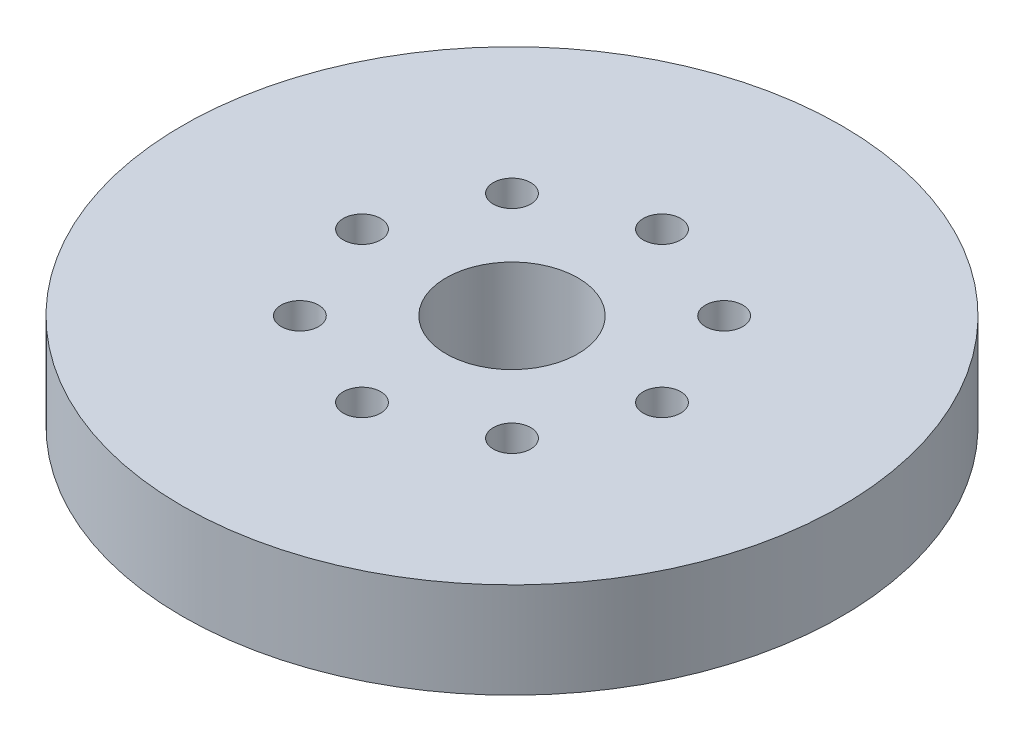
ISO-10303-21;
HEADER;
FILE_DESCRIPTION(('STEP AP214'),'2;1');
FILE_NAME('part.step','',(''),(''),'','','');
FILE_SCHEMA(('AUTOMOTIVE_DESIGN { 1 0 10303 214 1 1 1 1 }'));
ENDSEC;
DATA;
#1=APPLICATION_CONTEXT('core data for automotive mechanical design processes');
#2=APPLICATION_PROTOCOL_DEFINITION('international standard','automotive_design',2000,#1);
#3=PRODUCT_CONTEXT('',#1,'mechanical');
#4=PRODUCT('Part','Part','',(#3));
#5=PRODUCT_RELATED_PRODUCT_CATEGORY('part','',(#4));
#6=PRODUCT_DEFINITION_FORMATION('','',#4);
#7=PRODUCT_DEFINITION_CONTEXT('part definition',#1,'design');
#8=PRODUCT_DEFINITION('design','',#6,#7);
#9=PRODUCT_DEFINITION_SHAPE('','',#8);
#10=(LENGTH_UNIT() NAMED_UNIT(*) SI_UNIT(.MILLI.,.METRE.));
#11=(NAMED_UNIT(*) PLANE_ANGLE_UNIT() SI_UNIT($,.RADIAN.));
#12=(NAMED_UNIT(*) SI_UNIT($,.STERADIAN.) SOLID_ANGLE_UNIT());
#13=UNCERTAINTY_MEASURE_WITH_UNIT(LENGTH_MEASURE(1.E-05),#10,'distance_accuracy_value','');
#14=(GEOMETRIC_REPRESENTATION_CONTEXT(3) GLOBAL_UNCERTAINTY_ASSIGNED_CONTEXT((#13)) GLOBAL_UNIT_ASSIGNED_CONTEXT((#10,
#11,#12)) REPRESENTATION_CONTEXT('',''));
#15=CARTESIAN_POINT('',(0.,0.,0.));
#16=DIRECTION('',(0.,0.,1.));
#17=DIRECTION('',(1.,0.,0.));
#18=AXIS2_PLACEMENT_3D('',#15,#16,#17);
#19=CARTESIAN_POINT('',(0.,29.,0.));
#20=DIRECTION('',(0.,-1.,0.));
#21=DIRECTION('',(0.,0.,-1.));
#22=AXIS2_PLACEMENT_3D('',#19,#20,#21);
#23=CYLINDRICAL_SURFACE('',#22,100.);
#24=CARTESIAN_POINT('',(0.,29.,0.));
#25=DIRECTION('',(0.,1.,0.));
#26=DIRECTION('',(0.,0.,1.));
#27=AXIS2_PLACEMENT_3D('',#24,#25,#26);
#28=CIRCLE('',#27,100.);
#29=CARTESIAN_POINT('',(0.,29.,-100.));
#30=VERTEX_POINT('',#29);
#31=EDGE_CURVE('E10',#30,#30,#28,.T.);
#32=CARTESIAN_POINT('',(0.,0.,0.));
#33=DIRECTION('',(0.,1.,0.));
#34=DIRECTION('',(0.,0.,1.));
#35=AXIS2_PLACEMENT_3D('',#32,#33,#34);
#36=CIRCLE('',#35,100.);
#37=CARTESIAN_POINT('',(0.,0.,-100.));
#38=VERTEX_POINT('',#37);
#39=EDGE_CURVE('E37',#38,#38,#36,.T.);
#40=CARTESIAN_POINT('',(0.,29.,-100.));
#41=CARTESIAN_POINT('',(0.,28.6979166666667,-100.));
#42=CARTESIAN_POINT('',(0.,28.3958333333333,-100.));
#43=CARTESIAN_POINT('',(0.,27.7916666666667,-100.));
#44=CARTESIAN_POINT('',(0.,27.4895833333333,-100.));
#45=CARTESIAN_POINT('',(0.,26.8854166666667,-100.));
#46=CARTESIAN_POINT('',(0.,26.5833333333333,-100.));
#47=CARTESIAN_POINT('',(0.,25.9791666666667,-100.));
#48=CARTESIAN_POINT('',(0.,25.6770833333333,-100.));
#49=CARTESIAN_POINT('',(0.,25.0729166666667,-100.));
#50=CARTESIAN_POINT('',(0.,24.7708333333333,-100.));
#51=CARTESIAN_POINT('',(0.,24.1666666666667,-100.));
#52=CARTESIAN_POINT('',(0.,23.8645833333333,-100.));
#53=CARTESIAN_POINT('',(0.,23.2604166666667,-100.));
#54=CARTESIAN_POINT('',(0.,22.9583333333333,-100.));
#55=CARTESIAN_POINT('',(0.,22.3541666666667,-100.));
#56=CARTESIAN_POINT('',(0.,22.0520833333333,-100.));
#57=CARTESIAN_POINT('',(0.,21.4479166666667,-100.));
#58=CARTESIAN_POINT('',(0.,21.1458333333333,-100.));
#59=CARTESIAN_POINT('',(0.,20.5416666666667,-100.));
#60=CARTESIAN_POINT('',(0.,20.2395833333333,-100.));
#61=CARTESIAN_POINT('',(0.,19.6354166666667,-100.));
#62=CARTESIAN_POINT('',(0.,19.3333333333333,-100.));
#63=CARTESIAN_POINT('',(0.,18.7291666666667,-100.));
#64=CARTESIAN_POINT('',(0.,18.4270833333333,-100.));
#65=CARTESIAN_POINT('',(0.,17.8229166666667,-100.));
#66=CARTESIAN_POINT('',(0.,17.5208333333333,-100.));
#67=CARTESIAN_POINT('',(0.,16.9166666666667,-100.));
#68=CARTESIAN_POINT('',(0.,16.6145833333333,-100.));
#69=CARTESIAN_POINT('',(0.,16.0104166666667,-100.));
#70=CARTESIAN_POINT('',(0.,15.7083333333333,-100.));
#71=CARTESIAN_POINT('',(0.,15.1041666666667,-100.));
#72=CARTESIAN_POINT('',(0.,14.8020833333333,-100.));
#73=CARTESIAN_POINT('',(0.,14.1979166666667,-100.));
#74=CARTESIAN_POINT('',(0.,13.8958333333333,-100.));
#75=CARTESIAN_POINT('',(0.,13.2916666666667,-100.));
#76=CARTESIAN_POINT('',(0.,12.9895833333333,-100.));
#77=CARTESIAN_POINT('',(0.,12.3854166666667,-100.));
#78=CARTESIAN_POINT('',(0.,12.0833333333333,-100.));
#79=CARTESIAN_POINT('',(0.,11.4791666666667,-100.));
#80=CARTESIAN_POINT('',(0.,11.1770833333333,-100.));
#81=CARTESIAN_POINT('',(0.,10.5729166666667,-100.));
#82=CARTESIAN_POINT('',(0.,10.2708333333333,-100.));
#83=CARTESIAN_POINT('',(0.,9.66666666666667,-100.));
#84=CARTESIAN_POINT('',(0.,9.36458333333333,-100.));
#85=CARTESIAN_POINT('',(0.,8.76041666666667,-100.));
#86=CARTESIAN_POINT('',(0.,8.45833333333333,-100.));
#87=CARTESIAN_POINT('',(0.,7.85416666666667,-100.));
#88=CARTESIAN_POINT('',(0.,7.55208333333333,-100.));
#89=CARTESIAN_POINT('',(0.,6.94791666666667,-100.));
#90=CARTESIAN_POINT('',(0.,6.64583333333333,-100.));
#91=CARTESIAN_POINT('',(0.,6.04166666666667,-100.));
#92=CARTESIAN_POINT('',(0.,5.73958333333333,-100.));
#93=CARTESIAN_POINT('',(0.,5.13541666666667,-100.));
#94=CARTESIAN_POINT('',(0.,4.83333333333333,-100.));
#95=CARTESIAN_POINT('',(0.,4.22916666666667,-100.));
#96=CARTESIAN_POINT('',(0.,3.92708333333333,-100.));
#97=CARTESIAN_POINT('',(0.,3.32291666666667,-100.));
#98=CARTESIAN_POINT('',(0.,3.02083333333333,-100.));
#99=CARTESIAN_POINT('',(0.,2.41666666666667,-100.));
#100=CARTESIAN_POINT('',(0.,2.11458333333333,-100.));
#101=CARTESIAN_POINT('',(0.,1.51041666666667,-100.));
#102=CARTESIAN_POINT('',(0.,1.20833333333333,-100.));
#103=CARTESIAN_POINT('',(0.,0.604166666666667,-100.));
#104=CARTESIAN_POINT('',(0.,0.302083333333333,-100.));
#105=CARTESIAN_POINT('',(0.,0.,-100.));
#106=B_SPLINE_CURVE_WITH_KNOTS('',3,(#40,#41,#42,#43,#44,#45,#46,#47,#48,#49,#50,#51,#52,#53,
#54,#55,#56,#57,#58,#59,#60,#61,#62,#63,#64,#65,#66,#67,#68,#69,#70,#71,#72,#73,#74,#75,#76,#77,
#78,#79,#80,#81,#82,#83,#84,#85,#86,#87,#88,#89,#90,#91,#92,#93,#94,#95,#96,#97,#98,#99,#100,
#101,#102,#103,#104,#105),.UNSPECIFIED.,.F.,.F.,(4,2,2,2,2,2,2,2,2,2,2,2,2,2,2,2,2,2,2,2,2,2,2,
2,2,2,2,2,2,2,2,2,4),(0.,0.906249999999997,1.8125,2.71875,3.625,4.53125,5.4375,6.34375,7.25,
8.15625,9.0625,9.96875,10.875,11.78125,12.6875,13.59375,14.5,15.40625,16.3125,17.21875,18.125,
19.03125,19.9375,20.84375,21.75,22.65625,23.5625,24.46875,25.375,26.28125,27.1875,28.09375,29.),.UNSPECIFIED.);
#107=EDGE_CURVE('BSEAM40',#30,#38,#106,.T.);
#108=ORIENTED_EDGE('',*,*,#31,.F.);
#109=ORIENTED_EDGE('',*,*,#39,.T.);
#110=ORIENTED_EDGE('',*,*,#107,.T.);
#111=ORIENTED_EDGE('',*,*,#107,.F.);
#112=EDGE_LOOP('',(#108,#110,#109,#111));
#113=FACE_BOUND('',#112,.T.);
#114=ADVANCED_FACE('F40',(#113),#23,.T.);
#115=CARTESIAN_POINT('',(0.,29.,0.));
#116=DIRECTION('',(0.,1.,0.));
#117=DIRECTION('',(0.,0.,1.));
#118=AXIS2_PLACEMENT_3D('',#115,#116,#117);
#119=PLANE('',#118);
#120=CARTESIAN_POINT('',(1.5891330406652E-13,29.,45.514579241364));
#121=DIRECTION('',(0.,1.,0.));
#122=DIRECTION('',(1.,0.,0.));
#123=AXIS2_PLACEMENT_3D('',#120,#121,#122);
#124=CIRCLE('',#123,5.67155520492788);
#125=CARTESIAN_POINT('',(5.67155520492803,29.,45.514579241364));
#126=VERTEX_POINT('',#125);
#127=EDGE_CURVE('E88',#126,#126,#124,.T.);
#128=ORIENTED_EDGE('',*,*,#127,.F.);
#129=EDGE_LOOP('',(#128));
#130=FACE_BOUND('',#129,.T.);
#131=CARTESIAN_POINT('',(32.1836676244211,29.,32.1836676244208));
#132=DIRECTION('',(0.,1.,0.));
#133=DIRECTION('',(0.707106781186544,0.,-0.707106781186551));
#134=AXIS2_PLACEMENT_3D('',#131,#132,#133);
#135=CIRCLE('',#134,5.67155520492788);
#136=CARTESIAN_POINT('',(36.1940627696995,29.,28.1732724791424));
#137=VERTEX_POINT('',#136);
#138=EDGE_CURVE('E79',#137,#137,#135,.T.);
#139=ORIENTED_EDGE('',*,*,#138,.F.);
#140=EDGE_LOOP('',(#139));
#141=FACE_BOUND('',#140,.T.);
#142=CARTESIAN_POINT('',(45.514579241364,29.,0.));
#143=DIRECTION('',(0.,1.,0.));
#144=DIRECTION('',(0.,0.,-1.));
#145=AXIS2_PLACEMENT_3D('',#142,#143,#144);
#146=CIRCLE('',#145,5.67155520492788);
#147=CARTESIAN_POINT('',(45.514579241364,29.,-5.67155520492788));
#148=VERTEX_POINT('',#147);
#149=EDGE_CURVE('E74',#148,#148,#146,.T.);
#150=ORIENTED_EDGE('',*,*,#149,.F.);
#151=EDGE_LOOP('',(#150));
#152=FACE_BOUND('',#151,.T.);
#153=CARTESIAN_POINT('',(32.1836676244207,29.,-32.1836676244212));
#154=DIRECTION('',(0.,1.,0.));
#155=DIRECTION('',(-0.707106781186554,0.,-0.707106781186541));
#156=AXIS2_PLACEMENT_3D('',#153,#154,#155);
#157=CIRCLE('',#156,5.67155520492788);
#158=CARTESIAN_POINT('',(28.1732724791423,29.,-36.1940627696996));
#159=VERTEX_POINT('',#158);
#160=EDGE_CURVE('E70',#159,#159,#157,.T.);
#161=ORIENTED_EDGE('',*,*,#160,.F.);
#162=EDGE_LOOP('',(#161));
#163=FACE_BOUND('',#162,.T.);
#164=CARTESIAN_POINT('',(-4.76739912199559E-13,29.,-45.514579241364));
#165=DIRECTION('',(0.,1.,0.));
#166=DIRECTION('',(-1.,0.,0.));
#167=AXIS2_PLACEMENT_3D('',#164,#165,#166);
#168=CIRCLE('',#167,5.67155520492788);
#169=CARTESIAN_POINT('',(-5.67155520492835,29.,-45.514579241364));
#170=VERTEX_POINT('',#169);
#171=EDGE_CURVE('E100',#170,#170,#168,.T.);
#172=ORIENTED_EDGE('',*,*,#171,.F.);
#173=EDGE_LOOP('',(#172));
#174=FACE_BOUND('',#173,.T.);
#175=CARTESIAN_POINT('',(-32.1836676244214,29.,-32.1836676244206));
#176=DIRECTION('',(0.,1.,0.));
#177=DIRECTION('',(-0.707106781186539,0.,0.707106781186556));
#178=AXIS2_PLACEMENT_3D('',#175,#176,#177);
#179=CIRCLE('',#178,5.67155520492788);
#180=CARTESIAN_POINT('',(-36.1940627696997,29.,-28.1732724791422));
#181=VERTEX_POINT('',#180);
#182=EDGE_CURVE('E93',#181,#181,#179,.T.);
#183=ORIENTED_EDGE('',*,*,#182,.F.);
#184=EDGE_LOOP('',(#183));
#185=FACE_BOUND('',#184,.T.);
#186=CARTESIAN_POINT('',(-32.1836676244209,29.,32.183667624421));
#187=DIRECTION('',(0.,1.,0.));
#188=DIRECTION('',(0.707106781186549,0.,0.707106781186546));
#189=AXIS2_PLACEMENT_3D('',#186,#187,#188);
#190=CIRCLE('',#189,5.67155520492788);
#191=CARTESIAN_POINT('',(-28.1732724791425,29.,36.1940627696994));
#192=VERTEX_POINT('',#191);
#193=EDGE_CURVE('E61',#192,#192,#190,.T.);
#194=ORIENTED_EDGE('',*,*,#193,.F.);
#195=EDGE_LOOP('',(#194));
#196=FACE_BOUND('',#195,.T.);
#197=CARTESIAN_POINT('',(-45.514579241364,29.,0.));
#198=DIRECTION('',(0.,1.,0.));
#199=DIRECTION('',(0.,0.,1.));
#200=AXIS2_PLACEMENT_3D('',#197,#198,#199);
#201=CIRCLE('',#200,5.67155520492788);
#202=CARTESIAN_POINT('',(-45.514579241364,29.,5.67155520492788));
#203=VERTEX_POINT('',#202);
#204=EDGE_CURVE('E54',#203,#203,#201,.T.);
#205=ORIENTED_EDGE('',*,*,#204,.F.);
#206=EDGE_LOOP('',(#205));
#207=FACE_BOUND('',#206,.T.);
#208=CARTESIAN_POINT('',(0.,29.,0.));
#209=DIRECTION('',(0.,1.,0.));
#210=DIRECTION('',(0.,0.,1.));
#211=AXIS2_PLACEMENT_3D('',#208,#209,#210);
#212=CIRCLE('',#211,20.);
#213=CARTESIAN_POINT('',(0.,29.,-20.));
#214=VERTEX_POINT('',#213);
#215=EDGE_CURVE('E50',#214,#214,#212,.T.);
#216=ORIENTED_EDGE('',*,*,#215,.F.);
#217=EDGE_LOOP('',(#216));
#218=FACE_BOUND('',#217,.T.);
#219=ORIENTED_EDGE('',*,*,#31,.T.);
#220=EDGE_LOOP('',(#219));
#221=FACE_BOUND('',#220,.T.);
#222=ADVANCED_FACE('F115',(#130,#141,#152,#163,#174,#185,#196,#207,#218,#221),#119,.T.);
#223=CARTESIAN_POINT('',(0.,0.,0.));
#224=DIRECTION('',(0.,1.,0.));
#225=DIRECTION('',(0.,0.,1.));
#226=AXIS2_PLACEMENT_3D('',#223,#224,#225);
#227=PLANE('',#226);
#228=CARTESIAN_POINT('',(0.,0.,0.));
#229=DIRECTION('',(0.,1.,0.));
#230=DIRECTION('',(0.,0.,1.));
#231=AXIS2_PLACEMENT_3D('',#228,#229,#230);
#232=CIRCLE('',#231,20.);
#233=CARTESIAN_POINT('',(0.,0.,-20.));
#234=VERTEX_POINT('',#233);
#235=EDGE_CURVE('E47',#234,#234,#232,.T.);
#236=ORIENTED_EDGE('',*,*,#235,.T.);
#237=EDGE_LOOP('',(#236));
#238=FACE_BOUND('',#237,.T.);
#239=ORIENTED_EDGE('',*,*,#39,.F.);
#240=EDGE_LOOP('',(#239));
#241=FACE_BOUND('',#240,.T.);
#242=ADVANCED_FACE('F113',(#238,#241),#227,.F.);
#243=CARTESIAN_POINT('',(0.,29.,0.));
#244=DIRECTION('',(0.,-1.,0.));
#245=DIRECTION('',(0.,0.,-1.));
#246=AXIS2_PLACEMENT_3D('',#243,#244,#245);
#247=CYLINDRICAL_SURFACE('',#246,20.);
#248=CARTESIAN_POINT('',(0.,29.,-20.));
#249=CARTESIAN_POINT('',(0.,28.6979166666667,-20.));
#250=CARTESIAN_POINT('',(0.,28.3958333333333,-20.));
#251=CARTESIAN_POINT('',(0.,27.7916666666667,-20.));
#252=CARTESIAN_POINT('',(0.,27.4895833333333,-20.));
#253=CARTESIAN_POINT('',(0.,26.8854166666667,-20.));
#254=CARTESIAN_POINT('',(0.,26.5833333333333,-20.));
#255=CARTESIAN_POINT('',(0.,25.9791666666667,-20.));
#256=CARTESIAN_POINT('',(0.,25.6770833333333,-20.));
#257=CARTESIAN_POINT('',(0.,25.0729166666667,-20.));
#258=CARTESIAN_POINT('',(0.,24.7708333333333,-20.));
#259=CARTESIAN_POINT('',(0.,24.1666666666667,-20.));
#260=CARTESIAN_POINT('',(0.,23.8645833333333,-20.));
#261=CARTESIAN_POINT('',(0.,23.2604166666667,-20.));
#262=CARTESIAN_POINT('',(0.,22.9583333333333,-20.));
#263=CARTESIAN_POINT('',(0.,22.3541666666667,-20.));
#264=CARTESIAN_POINT('',(0.,22.0520833333333,-20.));
#265=CARTESIAN_POINT('',(0.,21.4479166666667,-20.));
#266=CARTESIAN_POINT('',(0.,21.1458333333333,-20.));
#267=CARTESIAN_POINT('',(0.,20.5416666666667,-20.));
#268=CARTESIAN_POINT('',(0.,20.2395833333333,-20.));
#269=CARTESIAN_POINT('',(0.,19.6354166666667,-20.));
#270=CARTESIAN_POINT('',(0.,19.3333333333333,-20.));
#271=CARTESIAN_POINT('',(0.,18.7291666666667,-20.));
#272=CARTESIAN_POINT('',(0.,18.4270833333333,-20.));
#273=CARTESIAN_POINT('',(0.,17.8229166666667,-20.));
#274=CARTESIAN_POINT('',(0.,17.5208333333333,-20.));
#275=CARTESIAN_POINT('',(0.,16.9166666666667,-20.));
#276=CARTESIAN_POINT('',(0.,16.6145833333333,-20.));
#277=CARTESIAN_POINT('',(0.,16.0104166666667,-20.));
#278=CARTESIAN_POINT('',(0.,15.7083333333333,-20.));
#279=CARTESIAN_POINT('',(0.,15.1041666666667,-20.));
#280=CARTESIAN_POINT('',(0.,14.8020833333333,-20.));
#281=CARTESIAN_POINT('',(0.,14.1979166666667,-20.));
#282=CARTESIAN_POINT('',(0.,13.8958333333333,-20.));
#283=CARTESIAN_POINT('',(0.,13.2916666666667,-20.));
#284=CARTESIAN_POINT('',(0.,12.9895833333333,-20.));
#285=CARTESIAN_POINT('',(0.,12.3854166666667,-20.));
#286=CARTESIAN_POINT('',(0.,12.0833333333333,-20.));
#287=CARTESIAN_POINT('',(0.,11.4791666666667,-20.));
#288=CARTESIAN_POINT('',(0.,11.1770833333333,-20.));
#289=CARTESIAN_POINT('',(0.,10.5729166666667,-20.));
#290=CARTESIAN_POINT('',(0.,10.2708333333333,-20.));
#291=CARTESIAN_POINT('',(0.,9.66666666666667,-20.));
#292=CARTESIAN_POINT('',(0.,9.36458333333333,-20.));
#293=CARTESIAN_POINT('',(0.,8.76041666666667,-20.));
#294=CARTESIAN_POINT('',(0.,8.45833333333333,-20.));
#295=CARTESIAN_POINT('',(0.,7.85416666666667,-20.));
#296=CARTESIAN_POINT('',(0.,7.55208333333333,-20.));
#297=CARTESIAN_POINT('',(0.,6.94791666666667,-20.));
#298=CARTESIAN_POINT('',(0.,6.64583333333333,-20.));
#299=CARTESIAN_POINT('',(0.,6.04166666666667,-20.));
#300=CARTESIAN_POINT('',(0.,5.73958333333333,-20.));
#301=CARTESIAN_POINT('',(0.,5.13541666666667,-20.));
#302=CARTESIAN_POINT('',(0.,4.83333333333333,-20.));
#303=CARTESIAN_POINT('',(0.,4.22916666666667,-20.));
#304=CARTESIAN_POINT('',(0.,3.92708333333333,-20.));
#305=CARTESIAN_POINT('',(0.,3.32291666666667,-20.));
#306=CARTESIAN_POINT('',(0.,3.02083333333333,-20.));
#307=CARTESIAN_POINT('',(0.,2.41666666666667,-20.));
#308=CARTESIAN_POINT('',(0.,2.11458333333333,-20.));
#309=CARTESIAN_POINT('',(0.,1.51041666666667,-20.));
#310=CARTESIAN_POINT('',(0.,1.20833333333333,-20.));
#311=CARTESIAN_POINT('',(0.,0.604166666666667,-20.));
#312=CARTESIAN_POINT('',(0.,0.302083333333333,-20.));
#313=CARTESIAN_POINT('',(0.,0.,-20.));
#314=B_SPLINE_CURVE_WITH_KNOTS('',3,(#248,#249,#250,#251,#252,#253,#254,#255,#256,#257,#258,
#259,#260,#261,#262,#263,#264,#265,#266,#267,#268,#269,#270,#271,#272,#273,#274,#275,#276,#277,
#278,#279,#280,#281,#282,#283,#284,#285,#286,#287,#288,#289,#290,#291,#292,#293,#294,#295,#296,
#297,#298,#299,#300,#301,#302,#303,#304,#305,#306,#307,#308,#309,#310,#311,#312,#313),
.UNSPECIFIED.,.F.,.F.,(4,2,2,2,2,2,2,2,2,2,2,2,2,2,2,2,2,2,2,2,2,2,2,2,2,2,2,2,2,2,2,2,4),(0.,
0.906249999999997,1.8125,2.71875,3.625,4.53125,5.4375,6.34375,7.25,8.15625,9.0625,9.96875,
10.875,11.78125,12.6875,13.59375,14.5,15.40625,16.3125,17.21875,18.125,19.03125,19.9375,
20.84375,21.75,22.65625,23.5625,24.46875,25.375,26.28125,27.1875,28.09375,29.),.UNSPECIFIED.);
#315=EDGE_CURVE('BSEAM127',#214,#234,#314,.T.);
#316=ORIENTED_EDGE('',*,*,#215,.T.);
#317=ORIENTED_EDGE('',*,*,#235,.F.);
#318=ORIENTED_EDGE('',*,*,#315,.T.);
#319=ORIENTED_EDGE('',*,*,#315,.F.);
#320=EDGE_LOOP('',(#316,#318,#317,#319));
#321=FACE_BOUND('',#320,.T.);
#322=ADVANCED_FACE('F127',(#321),#247,.F.);
#323=CARTESIAN_POINT('',(-45.514579241364,2.981767227513,0.));
#324=DIRECTION('',(0.,1.,0.));
#325=DIRECTION('',(0.,0.,1.));
#326=AXIS2_PLACEMENT_3D('',#323,#324,#325);
#327=CYLINDRICAL_SURFACE('',#326,5.67155520492788);
#328=CARTESIAN_POINT('',(-45.514579241364,2.981767227513,0.));
#329=DIRECTION('',(0.,1.,0.));
#330=DIRECTION('',(0.,0.,1.));
#331=AXIS2_PLACEMENT_3D('',#328,#329,#330);
#332=CIRCLE('',#331,5.67155520492788);
#333=CARTESIAN_POINT('',(-45.514579241364,2.981767227513,5.67155520492788));
#334=VERTEX_POINT('',#333);
#335=EDGE_CURVE('E55',#334,#334,#332,.T.);
#336=ORIENTED_EDGE('',*,*,#335,.F.);
#337=EDGE_LOOP('',(#336));
#338=FACE_BOUND('',#337,.T.);
#339=ORIENTED_EDGE('',*,*,#204,.T.);
#340=EDGE_LOOP('',(#339));
#341=FACE_BOUND('',#340,.T.);
#342=ADVANCED_FACE('F129',(#338,#341),#327,.F.);
#343=CARTESIAN_POINT('',(-45.514579241364,2.981767227513,0.));
#344=DIRECTION('',(0.,1.,0.));
#345=DIRECTION('',(0.,0.,1.));
#346=AXIS2_PLACEMENT_3D('',#343,#344,#345);
#347=PLANE('',#346);
#348=ORIENTED_EDGE('',*,*,#335,.T.);
#349=EDGE_LOOP('',(#348));
#350=FACE_BOUND('',#349,.T.);
#351=ADVANCED_FACE('F157',(#350),#347,.T.);
#352=CARTESIAN_POINT('',(-32.1836676244209,2.981767227513,32.183667624421));
#353=DIRECTION('',(0.,1.,0.));
#354=DIRECTION('',(0.,0.,1.));
#355=AXIS2_PLACEMENT_3D('',#352,#353,#354);
#356=CYLINDRICAL_SURFACE('',#355,5.67155520492788);
#357=CARTESIAN_POINT('',(-32.1836676244209,2.981767227513,32.183667624421));
#358=DIRECTION('',(0.,1.,0.));
#359=DIRECTION('',(0.707106781186549,0.,0.707106781186546));
#360=AXIS2_PLACEMENT_3D('',#357,#358,#359);
#361=CIRCLE('',#360,5.67155520492788);
#362=CARTESIAN_POINT('',(-28.1732724791425,2.981767227513,36.1940627696994));
#363=VERTEX_POINT('',#362);
#364=EDGE_CURVE('E59',#363,#363,#361,.T.);
#365=ORIENTED_EDGE('',*,*,#364,.F.);
#366=EDGE_LOOP('',(#365));
#367=FACE_BOUND('',#366,.T.);
#368=ORIENTED_EDGE('',*,*,#193,.T.);
#369=EDGE_LOOP('',(#368));
#370=FACE_BOUND('',#369,.T.);
#371=ADVANCED_FACE('F170',(#367,#370),#356,.F.);
#372=CARTESIAN_POINT('',(-32.1836676244209,2.981767227513,32.183667624421));
#373=DIRECTION('',(0.,1.,0.));
#374=DIRECTION('',(0.707106781186549,0.,0.707106781186546));
#375=AXIS2_PLACEMENT_3D('',#372,#373,#374);
#376=PLANE('',#375);
#377=ORIENTED_EDGE('',*,*,#364,.T.);
#378=EDGE_LOOP('',(#377));
#379=FACE_BOUND('',#378,.T.);
#380=ADVANCED_FACE('F182',(#379),#376,.T.);
#381=CARTESIAN_POINT('',(-32.1836676244214,2.981767227513,-32.1836676244206));
#382=DIRECTION('',(0.,1.,0.));
#383=DIRECTION('',(0.,0.,1.));
#384=AXIS2_PLACEMENT_3D('',#381,#382,#383);
#385=CYLINDRICAL_SURFACE('',#384,5.67155520492788);
#386=CARTESIAN_POINT('',(-32.1836676244214,2.981767227513,-32.1836676244206));
#387=DIRECTION('',(0.,1.,0.));
#388=DIRECTION('',(-0.707106781186539,0.,0.707106781186556));
#389=AXIS2_PLACEMENT_3D('',#386,#387,#388);
#390=CIRCLE('',#389,5.67155520492788);
#391=CARTESIAN_POINT('',(-36.1940627696997,2.981767227513,-28.1732724791422));
#392=VERTEX_POINT('',#391);
#393=EDGE_CURVE('E94',#392,#392,#390,.T.);
#394=ORIENTED_EDGE('',*,*,#393,.F.);
#395=EDGE_LOOP('',(#394));
#396=FACE_BOUND('',#395,.T.);
#397=ORIENTED_EDGE('',*,*,#182,.T.);
#398=EDGE_LOOP('',(#397));
#399=FACE_BOUND('',#398,.T.);
#400=ADVANCED_FACE('F189',(#396,#399),#385,.F.);
#401=CARTESIAN_POINT('',(-32.1836676244214,2.981767227513,-32.1836676244206));
#402=DIRECTION('',(0.,1.,0.));
#403=DIRECTION('',(-0.707106781186539,0.,0.707106781186556));
#404=AXIS2_PLACEMENT_3D('',#401,#402,#403);
#405=PLANE('',#404);
#406=ORIENTED_EDGE('',*,*,#393,.T.);
#407=EDGE_LOOP('',(#406));
#408=FACE_BOUND('',#407,.T.);
#409=ADVANCED_FACE('F107',(#408),#405,.T.);
#410=CARTESIAN_POINT('',(-4.76739912199559E-13,2.981767227513,-45.514579241364));
#411=DIRECTION('',(0.,1.,0.));
#412=DIRECTION('',(0.,0.,1.));
#413=AXIS2_PLACEMENT_3D('',#410,#411,#412);
#414=CYLINDRICAL_SURFACE('',#413,5.67155520492788);
#415=CARTESIAN_POINT('',(-4.76739912199559E-13,2.981767227513,-45.514579241364));
#416=DIRECTION('',(0.,1.,0.));
#417=DIRECTION('',(-1.,0.,0.));
#418=AXIS2_PLACEMENT_3D('',#415,#416,#417);
#419=CIRCLE('',#418,5.67155520492788);
#420=CARTESIAN_POINT('',(-5.67155520492835,2.981767227513,-45.514579241364));
#421=VERTEX_POINT('',#420);
#422=EDGE_CURVE('E72',#421,#421,#419,.T.);
#423=ORIENTED_EDGE('',*,*,#422,.F.);
#424=EDGE_LOOP('',(#423));
#425=FACE_BOUND('',#424,.T.);
#426=ORIENTED_EDGE('',*,*,#171,.T.);
#427=EDGE_LOOP('',(#426));
#428=FACE_BOUND('',#427,.T.);
#429=ADVANCED_FACE('F104',(#425,#428),#414,.F.);
#430=CARTESIAN_POINT('',(-4.76739912199559E-13,2.981767227513,-45.514579241364));
#431=DIRECTION('',(0.,1.,0.));
#432=DIRECTION('',(-1.,0.,0.));
#433=AXIS2_PLACEMENT_3D('',#430,#431,#432);
#434=PLANE('',#433);
#435=ORIENTED_EDGE('',*,*,#422,.T.);
#436=EDGE_LOOP('',(#435));
#437=FACE_BOUND('',#436,.T.);
#438=ADVANCED_FACE('F103',(#437),#434,.T.);
#439=CARTESIAN_POINT('',(32.1836676244207,2.981767227513,-32.1836676244212));
#440=DIRECTION('',(0.,1.,0.));
#441=DIRECTION('',(0.,0.,1.));
#442=AXIS2_PLACEMENT_3D('',#439,#440,#441);
#443=CYLINDRICAL_SURFACE('',#442,5.67155520492788);
#444=CARTESIAN_POINT('',(32.1836676244207,2.981767227513,-32.1836676244212));
#445=DIRECTION('',(0.,1.,0.));
#446=DIRECTION('',(-0.707106781186554,0.,-0.707106781186541));
#447=AXIS2_PLACEMENT_3D('',#444,#445,#446);
#448=CIRCLE('',#447,5.67155520492788);
#449=CARTESIAN_POINT('',(28.1732724791423,2.981767227513,-36.1940627696996));
#450=VERTEX_POINT('',#449);
#451=EDGE_CURVE('E69',#450,#450,#448,.T.);
#452=ORIENTED_EDGE('',*,*,#451,.F.);
#453=EDGE_LOOP('',(#452));
#454=FACE_BOUND('',#453,.T.);
#455=ORIENTED_EDGE('',*,*,#160,.T.);
#456=EDGE_LOOP('',(#455));
#457=FACE_BOUND('',#456,.T.);
#458=ADVANCED_FACE('F219',(#454,#457),#443,.F.);
#459=CARTESIAN_POINT('',(32.1836676244207,2.981767227513,-32.1836676244212));
#460=DIRECTION('',(0.,1.,0.));
#461=DIRECTION('',(-0.707106781186554,0.,-0.707106781186541));
#462=AXIS2_PLACEMENT_3D('',#459,#460,#461);
#463=PLANE('',#462);
#464=ORIENTED_EDGE('',*,*,#451,.T.);
#465=EDGE_LOOP('',(#464));
#466=FACE_BOUND('',#465,.T.);
#467=ADVANCED_FACE('F227',(#466),#463,.T.);
#468=CARTESIAN_POINT('',(45.514579241364,2.981767227513,0.));
#469=DIRECTION('',(0.,1.,0.));
#470=DIRECTION('',(0.,0.,1.));
#471=AXIS2_PLACEMENT_3D('',#468,#469,#470);
#472=CYLINDRICAL_SURFACE('',#471,5.67155520492788);
#473=CARTESIAN_POINT('',(45.514579241364,2.981767227513,0.));
#474=DIRECTION('',(0.,1.,0.));
#475=DIRECTION('',(0.,0.,-1.));
#476=AXIS2_PLACEMENT_3D('',#473,#474,#475);
#477=CIRCLE('',#476,5.67155520492788);
#478=CARTESIAN_POINT('',(45.514579241364,2.981767227513,-5.67155520492788));
#479=VERTEX_POINT('',#478);
#480=EDGE_CURVE('E80',#479,#479,#477,.T.);
#481=ORIENTED_EDGE('',*,*,#480,.F.);
#482=EDGE_LOOP('',(#481));
#483=FACE_BOUND('',#482,.T.);
#484=ORIENTED_EDGE('',*,*,#149,.T.);
#485=EDGE_LOOP('',(#484));
#486=FACE_BOUND('',#485,.T.);
#487=ADVANCED_FACE('F240',(#483,#486),#472,.F.);
#488=CARTESIAN_POINT('',(45.514579241364,2.981767227513,0.));
#489=DIRECTION('',(0.,1.,0.));
#490=DIRECTION('',(0.,0.,-1.));
#491=AXIS2_PLACEMENT_3D('',#488,#489,#490);
#492=PLANE('',#491);
#493=ORIENTED_EDGE('',*,*,#480,.T.);
#494=EDGE_LOOP('',(#493));
#495=FACE_BOUND('',#494,.T.);
#496=ADVANCED_FACE('F246',(#495),#492,.T.);
#497=CARTESIAN_POINT('',(32.1836676244211,2.981767227513,32.1836676244208));
#498=DIRECTION('',(0.,1.,0.));
#499=DIRECTION('',(0.,0.,1.));
#500=AXIS2_PLACEMENT_3D('',#497,#498,#499);
#501=CYLINDRICAL_SURFACE('',#500,5.67155520492788);
#502=CARTESIAN_POINT('',(32.1836676244211,2.981767227513,32.1836676244208));
#503=DIRECTION('',(0.,1.,0.));
#504=DIRECTION('',(0.707106781186544,0.,-0.707106781186551));
#505=AXIS2_PLACEMENT_3D('',#502,#503,#504);
#506=CIRCLE('',#505,5.67155520492788);
#507=CARTESIAN_POINT('',(36.1940627696995,2.981767227513,28.1732724791424));
#508=VERTEX_POINT('',#507);
#509=EDGE_CURVE('E82',#508,#508,#506,.T.);
#510=ORIENTED_EDGE('',*,*,#509,.F.);
#511=EDGE_LOOP('',(#510));
#512=FACE_BOUND('',#511,.T.);
#513=ORIENTED_EDGE('',*,*,#138,.T.);
#514=EDGE_LOOP('',(#513));
#515=FACE_BOUND('',#514,.T.);
#516=ADVANCED_FACE('F254',(#512,#515),#501,.F.);
#517=CARTESIAN_POINT('',(32.1836676244211,2.981767227513,32.1836676244208));
#518=DIRECTION('',(0.,1.,0.));
#519=DIRECTION('',(0.707106781186544,0.,-0.707106781186551));
#520=AXIS2_PLACEMENT_3D('',#517,#518,#519);
#521=PLANE('',#520);
#522=ORIENTED_EDGE('',*,*,#509,.T.);
#523=EDGE_LOOP('',(#522));
#524=FACE_BOUND('',#523,.T.);
#525=ADVANCED_FACE('F262',(#524),#521,.T.);
#526=CARTESIAN_POINT('',(1.5891330406652E-13,2.981767227513,45.514579241364));
#527=DIRECTION('',(0.,1.,0.));
#528=DIRECTION('',(0.,0.,1.));
#529=AXIS2_PLACEMENT_3D('',#526,#527,#528);
#530=CYLINDRICAL_SURFACE('',#529,5.67155520492788);
#531=CARTESIAN_POINT('',(1.5891330406652E-13,2.981767227513,45.514579241364));
#532=DIRECTION('',(0.,1.,0.));
#533=DIRECTION('',(1.,0.,0.));
#534=AXIS2_PLACEMENT_3D('',#531,#532,#533);
#535=CIRCLE('',#534,5.67155520492788);
#536=CARTESIAN_POINT('',(5.67155520492803,2.981767227513,45.514579241364));
#537=VERTEX_POINT('',#536);
#538=EDGE_CURVE('E63',#537,#537,#535,.T.);
#539=ORIENTED_EDGE('',*,*,#538,.F.);
#540=EDGE_LOOP('',(#539));
#541=FACE_BOUND('',#540,.T.);
#542=ORIENTED_EDGE('',*,*,#127,.T.);
#543=EDGE_LOOP('',(#542));
#544=FACE_BOUND('',#543,.T.);
#545=ADVANCED_FACE('F272',(#541,#544),#530,.F.);
#546=CARTESIAN_POINT('',(1.5891330406652E-13,2.981767227513,45.514579241364));
#547=DIRECTION('',(0.,1.,0.));
#548=DIRECTION('',(1.,0.,0.));
#549=AXIS2_PLACEMENT_3D('',#546,#547,#548);
#550=PLANE('',#549);
#551=ORIENTED_EDGE('',*,*,#538,.T.);
#552=EDGE_LOOP('',(#551));
#553=FACE_BOUND('',#552,.T.);
#554=ADVANCED_FACE('F285',(#553),#550,.T.);
#555=CLOSED_SHELL('',(#114,#222,#242,#322,#342,#351,#371,#380,#400,#409,#429,#438,#458,#467,
#487,#496,#516,#525,#545,#554));
#556=MANIFOLD_SOLID_BREP('B2',#555);
#557=ADVANCED_BREP_SHAPE_REPRESENTATION('',(#18,#556),#14);
#558=SHAPE_DEFINITION_REPRESENTATION(#9,#557);
ENDSEC;
END-ISO-10303-21;
